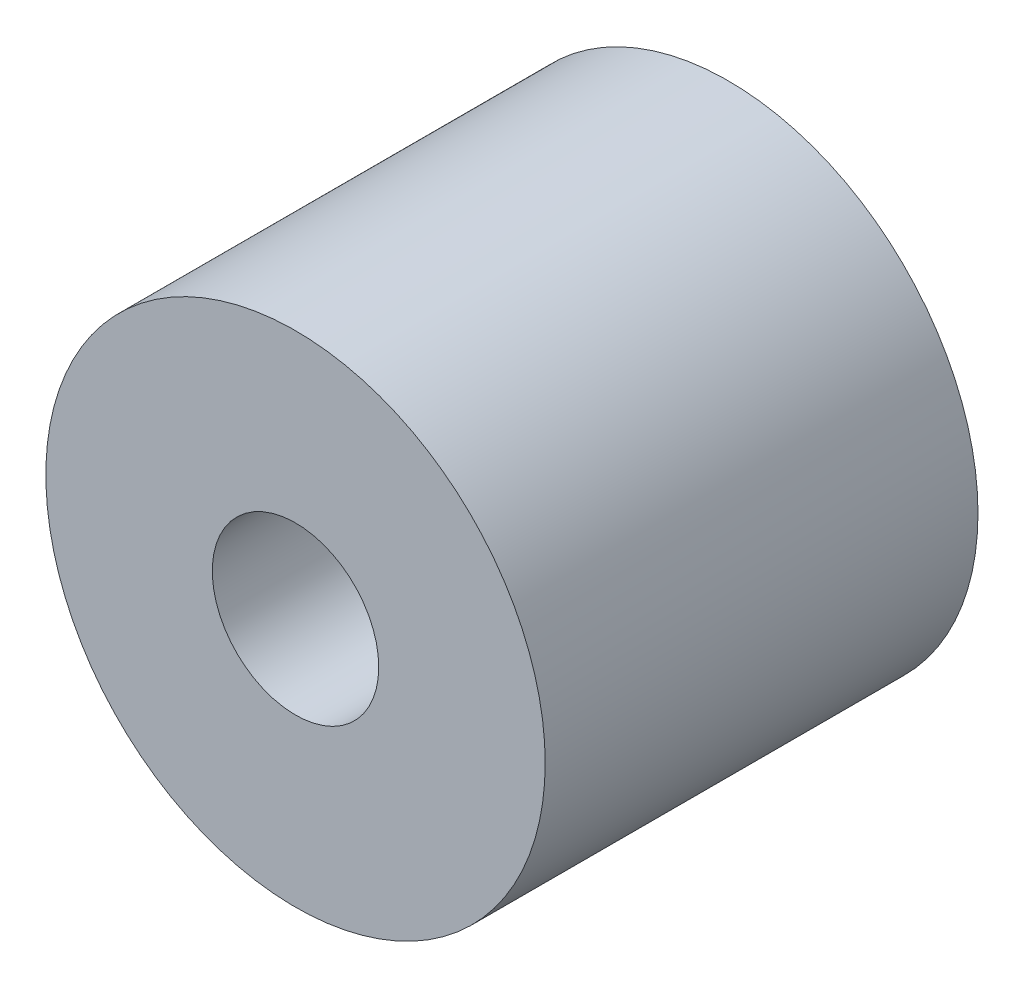
ISO-10303-21;
HEADER;
FILE_DESCRIPTION(('STEP AP214'),'2;1');
FILE_NAME('part.step','',(''),(''),'','','');
FILE_SCHEMA(('AUTOMOTIVE_DESIGN { 1 0 10303 214 1 1 1 1 }'));
ENDSEC;
DATA;
#1=APPLICATION_CONTEXT('core data for automotive mechanical design processes');
#2=APPLICATION_PROTOCOL_DEFINITION('international standard','automotive_design',2000,#1);
#3=PRODUCT_CONTEXT('',#1,'mechanical');
#4=PRODUCT('Part','Part','',(#3));
#5=PRODUCT_RELATED_PRODUCT_CATEGORY('part','',(#4));
#6=PRODUCT_DEFINITION_FORMATION('','',#4);
#7=PRODUCT_DEFINITION_CONTEXT('part definition',#1,'design');
#8=PRODUCT_DEFINITION('design','',#6,#7);
#9=PRODUCT_DEFINITION_SHAPE('','',#8);
#10=(LENGTH_UNIT() NAMED_UNIT(*) SI_UNIT(.MILLI.,.METRE.));
#11=(NAMED_UNIT(*) PLANE_ANGLE_UNIT() SI_UNIT($,.RADIAN.));
#12=(NAMED_UNIT(*) SI_UNIT($,.STERADIAN.) SOLID_ANGLE_UNIT());
#13=UNCERTAINTY_MEASURE_WITH_UNIT(LENGTH_MEASURE(1.E-05),#10,'distance_accuracy_value','');
#14=(GEOMETRIC_REPRESENTATION_CONTEXT(3) GLOBAL_UNCERTAINTY_ASSIGNED_CONTEXT((#13)) GLOBAL_UNIT_ASSIGNED_CONTEXT((#10,
#11,#12)) REPRESENTATION_CONTEXT('',''));
#15=CARTESIAN_POINT('',(0.,0.,0.));
#16=DIRECTION('',(0.,0.,1.));
#17=DIRECTION('',(1.,0.,0.));
#18=AXIS2_PLACEMENT_3D('',#15,#16,#17);
#19=CARTESIAN_POINT('',(0.,0.,130.));
#20=DIRECTION('',(0.,0.,1.));
#21=DIRECTION('',(1.,0.,0.));
#22=AXIS2_PLACEMENT_3D('',#19,#20,#21);
#23=PLANE('',#22);
#24=CARTESIAN_POINT('',(0.,0.,130.));
#25=DIRECTION('',(0.,0.,1.));
#26=DIRECTION('',(1.,0.,0.));
#27=AXIS2_PLACEMENT_3D('',#24,#25,#26);
#28=CIRCLE('',#27,75.);
#29=CARTESIAN_POINT('',(75.,0.,130.));
#30=VERTEX_POINT('',#29);
#31=EDGE_CURVE('E10',#30,#30,#28,.T.);
#32=ORIENTED_EDGE('',*,*,#31,.T.);
#33=EDGE_LOOP('',(#32));
#34=FACE_BOUND('',#33,.T.);
#35=CARTESIAN_POINT('',(0.,0.,130.));
#36=DIRECTION('',(0.,0.,1.));
#37=DIRECTION('',(1.,0.,0.));
#38=AXIS2_PLACEMENT_3D('',#35,#36,#37);
#39=CIRCLE('',#38,25.);
#40=CARTESIAN_POINT('',(25.,0.,130.));
#41=VERTEX_POINT('',#40);
#42=EDGE_CURVE('E42',#41,#41,#39,.T.);
#43=ORIENTED_EDGE('',*,*,#42,.F.);
#44=EDGE_LOOP('',(#43));
#45=FACE_BOUND('',#44,.T.);
#46=ADVANCED_FACE('F31',(#34,#45),#23,.T.);
#47=CARTESIAN_POINT('',(0.,0.,0.));
#48=DIRECTION('',(0.,0.,1.));
#49=DIRECTION('',(1.,0.,0.));
#50=AXIS2_PLACEMENT_3D('',#47,#48,#49);
#51=PLANE('',#50);
#52=CARTESIAN_POINT('',(0.,0.,0.));
#53=DIRECTION('',(0.,0.,1.));
#54=DIRECTION('',(1.,0.,0.));
#55=AXIS2_PLACEMENT_3D('',#52,#53,#54);
#56=CIRCLE('',#55,75.);
#57=CARTESIAN_POINT('',(75.,0.,0.));
#58=VERTEX_POINT('',#57);
#59=EDGE_CURVE('E35',#58,#58,#56,.T.);
#60=ORIENTED_EDGE('',*,*,#59,.F.);
#61=EDGE_LOOP('',(#60));
#62=FACE_BOUND('',#61,.T.);
#63=CARTESIAN_POINT('',(0.,0.,0.));
#64=DIRECTION('',(0.,0.,1.));
#65=DIRECTION('',(1.,0.,0.));
#66=AXIS2_PLACEMENT_3D('',#63,#64,#65);
#67=CIRCLE('',#66,25.);
#68=CARTESIAN_POINT('',(25.,0.,0.));
#69=VERTEX_POINT('',#68);
#70=EDGE_CURVE('E44',#69,#69,#67,.T.);
#71=ORIENTED_EDGE('',*,*,#70,.T.);
#72=EDGE_LOOP('',(#71));
#73=FACE_BOUND('',#72,.T.);
#74=ADVANCED_FACE('F54',(#62,#73),#51,.F.);
#75=CARTESIAN_POINT('',(0.,0.,130.));
#76=DIRECTION('',(0.,0.,-1.));
#77=DIRECTION('',(-1.,0.,0.));
#78=AXIS2_PLACEMENT_3D('',#75,#76,#77);
#79=CYLINDRICAL_SURFACE('',#78,75.);
#80=ORIENTED_EDGE('',*,*,#31,.F.);
#81=EDGE_LOOP('',(#80));
#82=FACE_BOUND('',#81,.T.);
#83=ORIENTED_EDGE('',*,*,#59,.T.);
#84=EDGE_LOOP('',(#83));
#85=FACE_BOUND('',#84,.T.);
#86=ADVANCED_FACE('F33',(#82,#85),#79,.T.);
#87=CARTESIAN_POINT('',(0.,0.,130.));
#88=DIRECTION('',(0.,0.,-1.));
#89=DIRECTION('',(-1.,0.,0.));
#90=AXIS2_PLACEMENT_3D('',#87,#88,#89);
#91=CYLINDRICAL_SURFACE('',#90,25.);
#92=ORIENTED_EDGE('',*,*,#42,.T.);
#93=EDGE_LOOP('',(#92));
#94=FACE_BOUND('',#93,.T.);
#95=ORIENTED_EDGE('',*,*,#70,.F.);
#96=EDGE_LOOP('',(#95));
#97=FACE_BOUND('',#96,.T.);
#98=ADVANCED_FACE('F50',(#94,#97),#91,.F.);
#99=CLOSED_SHELL('',(#46,#74,#86,#98));
#100=MANIFOLD_SOLID_BREP('B2',#99);
#101=ADVANCED_BREP_SHAPE_REPRESENTATION('',(#18,#100),#14);
#102=SHAPE_DEFINITION_REPRESENTATION(#9,#101);
ENDSEC;
END-ISO-10303-21;
